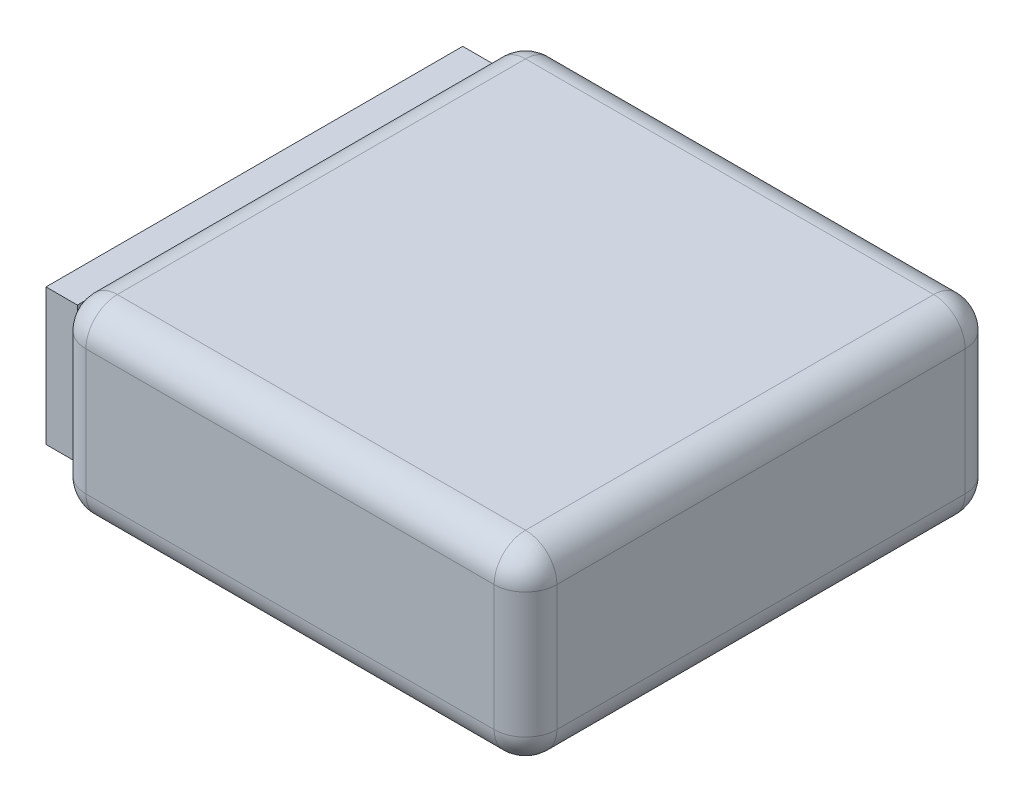
ISO-10303-21;
HEADER;
FILE_DESCRIPTION(('STEP AP214'),'2;1');
FILE_NAME('part.step','',(''),(''),'','','');
FILE_SCHEMA(('AUTOMOTIVE_DESIGN { 1 0 10303 214 1 1 1 1 }'));
ENDSEC;
DATA;
#1=APPLICATION_CONTEXT('core data for automotive mechanical design processes');
#2=APPLICATION_PROTOCOL_DEFINITION('international standard','automotive_design',2000,#1);
#3=PRODUCT_CONTEXT('',#1,'mechanical');
#4=PRODUCT('Part','Part','',(#3));
#5=PRODUCT_RELATED_PRODUCT_CATEGORY('part','',(#4));
#6=PRODUCT_DEFINITION_FORMATION('','',#4);
#7=PRODUCT_DEFINITION_CONTEXT('part definition',#1,'design');
#8=PRODUCT_DEFINITION('design','',#6,#7);
#9=PRODUCT_DEFINITION_SHAPE('','',#8);
#10=(LENGTH_UNIT() NAMED_UNIT(*) SI_UNIT(.MILLI.,.METRE.));
#11=(NAMED_UNIT(*) PLANE_ANGLE_UNIT() SI_UNIT($,.RADIAN.));
#12=(NAMED_UNIT(*) SI_UNIT($,.STERADIAN.) SOLID_ANGLE_UNIT());
#13=UNCERTAINTY_MEASURE_WITH_UNIT(LENGTH_MEASURE(1.E-05),#10,'distance_accuracy_value','');
#14=(GEOMETRIC_REPRESENTATION_CONTEXT(3) GLOBAL_UNCERTAINTY_ASSIGNED_CONTEXT((#13)) GLOBAL_UNIT_ASSIGNED_CONTEXT((#10,
#11,#12)) REPRESENTATION_CONTEXT('',''));
#15=CARTESIAN_POINT('',(0.,0.,0.));
#16=DIRECTION('',(0.,0.,1.));
#17=DIRECTION('',(1.,0.,0.));
#18=AXIS2_PLACEMENT_3D('',#15,#16,#17);
#19=CARTESIAN_POINT('',(-19.787002788647,6.,12.1518006256364));
#20=DIRECTION('',(0.,0.,-1.));
#21=DIRECTION('',(-1.,0.,0.));
#22=AXIS2_PLACEMENT_3D('',#19,#20,#21);
#23=PLANE('',#22);
#24=DIRECTION('',(0.,-1.,0.));
#25=VECTOR('',#24,1.);
#26=CARTESIAN_POINT('',(-18.787002788647,6.,12.1518006256364));
#27=LINE('',#26,#25);
#28=CARTESIAN_POINT('',(-18.787002788647,5.,12.1518006256364));
#29=VERTEX_POINT('',#28);
#30=CARTESIAN_POINT('',(-18.787002788647,1.,12.1518006256364));
#31=VERTEX_POINT('',#30);
#32=EDGE_CURVE('E216',#29,#31,#27,.T.);
#33=ORIENTED_EDGE('',*,*,#32,.T.);
#34=DIRECTION('',(1.,0.,0.));
#35=VECTOR('',#34,1.);
#36=CARTESIAN_POINT('',(-4.78700278864695,1.,12.1518006256364));
#37=LINE('',#36,#35);
#38=CARTESIAN_POINT('',(-5.78700278864695,1.,12.1518006256364));
#39=VERTEX_POINT('',#38);
#40=EDGE_CURVE('E220',#31,#39,#37,.T.);
#41=ORIENTED_EDGE('',*,*,#40,.T.);
#42=DIRECTION('',(0.,-1.,0.));
#43=VECTOR('',#42,1.);
#44=CARTESIAN_POINT('',(-5.78700278864695,6.,12.1518006256364));
#45=LINE('',#44,#43);
#46=CARTESIAN_POINT('',(-5.78700278864695,5.,12.1518006256364));
#47=VERTEX_POINT('',#46);
#48=EDGE_CURVE('E218',#39,#47,#45,.F.);
#49=ORIENTED_EDGE('',*,*,#48,.T.);
#50=DIRECTION('',(1.,0.,0.));
#51=VECTOR('',#50,1.);
#52=CARTESIAN_POINT('',(-19.787002788647,5.,12.1518006256364));
#53=LINE('',#52,#51);
#54=EDGE_CURVE('E214',#47,#29,#53,.F.);
#55=ORIENTED_EDGE('',*,*,#54,.T.);
#56=EDGE_LOOP('',(#33,#41,#49,#55));
#57=FACE_BOUND('',#56,.T.);
#58=ADVANCED_FACE('F32',(#57),#23,.F.);
#59=CARTESIAN_POINT('',(-4.78700278864695,6.,12.1518006256364));
#60=DIRECTION('',(-1.,0.,0.));
#61=DIRECTION('',(0.,0.,1.));
#62=AXIS2_PLACEMENT_3D('',#59,#60,#61);
#63=PLANE('',#62);
#64=DIRECTION('',(0.,-1.,0.));
#65=VECTOR('',#64,1.);
#66=CARTESIAN_POINT('',(-4.78700278864695,6.,11.1518006256364));
#67=LINE('',#66,#65);
#68=CARTESIAN_POINT('',(-4.78700278864695,5.,11.1518006256364));
#69=VERTEX_POINT('',#68);
#70=CARTESIAN_POINT('',(-4.78700278864695,1.,11.1518006256364));
#71=VERTEX_POINT('',#70);
#72=EDGE_CURVE('E207',#69,#71,#67,.T.);
#73=ORIENTED_EDGE('',*,*,#72,.T.);
#74=DIRECTION('',(0.,0.,-1.));
#75=VECTOR('',#74,1.);
#76=CARTESIAN_POINT('',(-4.78700278864695,1.,-2.84819937436359));
#77=LINE('',#76,#75);
#78=CARTESIAN_POINT('',(-4.78700278864695,1.,-1.84819937436359));
#79=VERTEX_POINT('',#78);
#80=EDGE_CURVE('E211',#71,#79,#77,.T.);
#81=ORIENTED_EDGE('',*,*,#80,.T.);
#82=DIRECTION('',(0.,-1.,0.));
#83=VECTOR('',#82,1.);
#84=CARTESIAN_POINT('',(-4.78700278864695,6.,-1.84819937436359));
#85=LINE('',#84,#83);
#86=CARTESIAN_POINT('',(-4.78700278864695,5.,-1.84819937436359));
#87=VERTEX_POINT('',#86);
#88=EDGE_CURVE('E209',#79,#87,#85,.F.);
#89=ORIENTED_EDGE('',*,*,#88,.T.);
#90=DIRECTION('',(0.,0.,-1.));
#91=VECTOR('',#90,1.);
#92=CARTESIAN_POINT('',(-4.78700278864695,5.,12.1518006256364));
#93=LINE('',#92,#91);
#94=EDGE_CURVE('E205',#87,#69,#93,.F.);
#95=ORIENTED_EDGE('',*,*,#94,.T.);
#96=EDGE_LOOP('',(#73,#81,#89,#95));
#97=FACE_BOUND('',#96,.T.);
#98=ADVANCED_FACE('F344',(#97),#63,.F.);
#99=CARTESIAN_POINT('',(-19.787002788647,6.,-2.84819937436359));
#100=DIRECTION('',(0.,0.,1.));
#101=DIRECTION('',(1.,0.,0.));
#102=AXIS2_PLACEMENT_3D('',#99,#100,#101);
#103=PLANE('',#102);
#104=DIRECTION('',(-1.,0.,0.));
#105=VECTOR('',#104,1.);
#106=CARTESIAN_POINT('',(-19.787002788647,1.,-2.84819937436359));
#107=LINE('',#106,#105);
#108=CARTESIAN_POINT('',(-5.78700278864695,1.,-2.84819937436359));
#109=VERTEX_POINT('',#108);
#110=CARTESIAN_POINT('',(-18.787002788647,1.,-2.84819937436359));
#111=VERTEX_POINT('',#110);
#112=EDGE_CURVE('E191',#109,#111,#107,.T.);
#113=ORIENTED_EDGE('',*,*,#112,.T.);
#114=DIRECTION('',(0.,-1.,0.));
#115=VECTOR('',#114,1.);
#116=CARTESIAN_POINT('',(-18.787002788647,6.,-2.84819937436359));
#117=LINE('',#116,#115);
#118=CARTESIAN_POINT('',(-18.787002788647,5.,-2.84819937436359));
#119=VERTEX_POINT('',#118);
#120=EDGE_CURVE('E193',#111,#119,#117,.F.);
#121=ORIENTED_EDGE('',*,*,#120,.T.);
#122=DIRECTION('',(-1.,0.,0.));
#123=VECTOR('',#122,1.);
#124=CARTESIAN_POINT('',(-19.787002788647,5.,-2.84819937436359));
#125=LINE('',#124,#123);
#126=CARTESIAN_POINT('',(-5.78700278864695,5.,-2.84819937436359));
#127=VERTEX_POINT('',#126);
#128=EDGE_CURVE('E187',#119,#127,#125,.F.);
#129=ORIENTED_EDGE('',*,*,#128,.T.);
#130=DIRECTION('',(0.,-1.,0.));
#131=VECTOR('',#130,1.);
#132=CARTESIAN_POINT('',(-5.78700278864695,6.,-2.84819937436359));
#133=LINE('',#132,#131);
#134=EDGE_CURVE('E189',#127,#109,#133,.T.);
#135=ORIENTED_EDGE('',*,*,#134,.T.);
#136=EDGE_LOOP('',(#113,#121,#129,#135));
#137=FACE_BOUND('',#136,.T.);
#138=ADVANCED_FACE('F358',(#137),#103,.F.);
#139=CARTESIAN_POINT('',(0.,6.,0.));
#140=DIRECTION('',(0.,-1.,0.));
#141=DIRECTION('',(0.,0.,-1.));
#142=AXIS2_PLACEMENT_3D('',#139,#140,#141);
#143=PLANE('',#142);
#144=DIRECTION('',(-1.,0.,0.));
#145=VECTOR('',#144,1.);
#146=CARTESIAN_POINT('',(0.,6.,-1.84819937436359));
#147=LINE('',#146,#145);
#148=CARTESIAN_POINT('',(-5.78700278864695,6.,-1.84819937436359));
#149=VERTEX_POINT('',#148);
#150=CARTESIAN_POINT('',(-18.787002788647,6.,-1.84819937436359));
#151=VERTEX_POINT('',#150);
#152=EDGE_CURVE('E41',#149,#151,#147,.T.);
#153=ORIENTED_EDGE('',*,*,#152,.T.);
#154=DIRECTION('',(0.,0.,1.));
#155=VECTOR('',#154,1.);
#156=CARTESIAN_POINT('',(-18.787002788647,6.,0.));
#157=LINE('',#156,#155);
#158=CARTESIAN_POINT('',(-18.787002788647,6.,11.1518006256364));
#159=VERTEX_POINT('',#158);
#160=EDGE_CURVE('E11',#151,#159,#157,.T.);
#161=ORIENTED_EDGE('',*,*,#160,.T.);
#162=DIRECTION('',(1.,0.,0.));
#163=VECTOR('',#162,1.);
#164=CARTESIAN_POINT('',(0.,6.,11.1518006256364));
#165=LINE('',#164,#163);
#166=CARTESIAN_POINT('',(-5.78700278864695,6.,11.1518006256364));
#167=VERTEX_POINT('',#166);
#168=EDGE_CURVE('E223',#159,#167,#165,.T.);
#169=ORIENTED_EDGE('',*,*,#168,.T.);
#170=DIRECTION('',(0.,0.,-1.));
#171=VECTOR('',#170,1.);
#172=CARTESIAN_POINT('',(-5.78700278864695,6.,0.));
#173=LINE('',#172,#171);
#174=EDGE_CURVE('E52',#167,#149,#173,.T.);
#175=ORIENTED_EDGE('',*,*,#174,.T.);
#176=EDGE_LOOP('',(#153,#161,#169,#175));
#177=FACE_BOUND('',#176,.T.);
#178=ADVANCED_FACE('F317',(#177),#143,.F.);
#179=CARTESIAN_POINT('',(0.,0.,0.));
#180=DIRECTION('',(0.,-1.,0.));
#181=DIRECTION('',(0.,0.,-1.));
#182=AXIS2_PLACEMENT_3D('',#179,#180,#181);
#183=PLANE('',#182);
#184=DIRECTION('',(0.,0.,1.));
#185=VECTOR('',#184,1.);
#186=CARTESIAN_POINT('',(-18.787002788647,0.,-2.84819937436359));
#187=LINE('',#186,#185);
#188=CARTESIAN_POINT('',(-18.787002788647,0.,11.1518006256364));
#189=VERTEX_POINT('',#188);
#190=CARTESIAN_POINT('',(-18.787002788647,0.,-1.84819937436359));
#191=VERTEX_POINT('',#190);
#192=EDGE_CURVE('E200',#189,#191,#187,.F.);
#193=ORIENTED_EDGE('',*,*,#192,.T.);
#194=DIRECTION('',(-1.,0.,0.));
#195=VECTOR('',#194,1.);
#196=CARTESIAN_POINT('',(-4.78700278864695,0.,-1.84819937436359));
#197=LINE('',#196,#195);
#198=CARTESIAN_POINT('',(-5.78700278864695,0.,-1.84819937436359));
#199=VERTEX_POINT('',#198);
#200=EDGE_CURVE('E202',#191,#199,#197,.F.);
#201=ORIENTED_EDGE('',*,*,#200,.T.);
#202=DIRECTION('',(0.,0.,-1.));
#203=VECTOR('',#202,1.);
#204=CARTESIAN_POINT('',(-5.78700278864695,0.,12.1518006256364));
#205=LINE('',#204,#203);
#206=CARTESIAN_POINT('',(-5.78700278864695,0.,11.1518006256364));
#207=VERTEX_POINT('',#206);
#208=EDGE_CURVE('E198',#199,#207,#205,.F.);
#209=ORIENTED_EDGE('',*,*,#208,.T.);
#210=DIRECTION('',(1.,0.,0.));
#211=VECTOR('',#210,1.);
#212=CARTESIAN_POINT('',(-19.787002788647,0.,11.1518006256364));
#213=LINE('',#212,#211);
#214=EDGE_CURVE('E196',#207,#189,#213,.F.);
#215=ORIENTED_EDGE('',*,*,#214,.T.);
#216=EDGE_LOOP('',(#193,#201,#209,#215));
#217=FACE_BOUND('',#216,.T.);
#218=ADVANCED_FACE('F346',(#217),#183,.T.);
#219=CARTESIAN_POINT('',(-5.78700278864695,6.,11.1518006256364));
#220=DIRECTION('',(0.,-1.,0.));
#221=DIRECTION('',(0.,0.,-1.));
#222=AXIS2_PLACEMENT_3D('',#219,#220,#221);
#223=CYLINDRICAL_SURFACE('',#222,1.);
#224=CARTESIAN_POINT('',(-5.78700278864695,5.,11.1518006256364));
#225=DIRECTION('',(0.,1.,0.));
#226=DIRECTION('',(0.,0.,1.));
#227=AXIS2_PLACEMENT_3D('',#224,#225,#226);
#228=CIRCLE('',#227,1.);
#229=EDGE_CURVE('E36',#47,#69,#228,.T.);
#230=ORIENTED_EDGE('',*,*,#229,.F.);
#231=ORIENTED_EDGE('',*,*,#48,.F.);
#232=CARTESIAN_POINT('',(-5.78700278864695,1.,11.1518006256364));
#233=DIRECTION('',(0.,-1.,0.));
#234=DIRECTION('',(0.,0.,-1.));
#235=AXIS2_PLACEMENT_3D('',#232,#233,#234);
#236=CIRCLE('',#235,1.);
#237=EDGE_CURVE('E283',#71,#39,#236,.T.);
#238=ORIENTED_EDGE('',*,*,#237,.F.);
#239=ORIENTED_EDGE('',*,*,#72,.F.);
#240=EDGE_LOOP('',(#230,#231,#238,#239));
#241=FACE_BOUND('',#240,.T.);
#242=ADVANCED_FACE('F34',(#241),#223,.T.);
#243=CARTESIAN_POINT('',(-5.78700278864695,5.,11.1518006256364));
#244=DIRECTION('',(0.,0.,1.));
#245=DIRECTION('',(1.,0.,0.));
#246=AXIS2_PLACEMENT_3D('',#243,#244,#245);
#247=SPHERICAL_SURFACE('',#246,1.);
#248=CARTESIAN_POINT('',(-5.78700278864695,5.,11.1518006256364));
#249=DIRECTION('',(1.,0.,0.));
#250=DIRECTION('',(0.,0.,-1.));
#251=AXIS2_PLACEMENT_3D('',#248,#249,#250);
#252=CIRCLE('',#251,1.);
#253=EDGE_CURVE('E278',#47,#167,#252,.F.);
#254=ORIENTED_EDGE('',*,*,#253,.F.);
#255=ORIENTED_EDGE('',*,*,#229,.T.);
#256=CARTESIAN_POINT('',(-5.78700278864695,5.,11.1518006256364));
#257=DIRECTION('',(0.,0.,1.));
#258=DIRECTION('',(1.,0.,0.));
#259=AXIS2_PLACEMENT_3D('',#256,#257,#258);
#260=CIRCLE('',#259,1.);
#261=EDGE_CURVE('E281',#167,#69,#260,.F.);
#262=ORIENTED_EDGE('',*,*,#261,.F.);
#263=EDGE_LOOP('',(#254,#255,#262));
#264=FACE_BOUND('',#263,.T.);
#265=ADVANCED_FACE('F295',(#264),#247,.T.);
#266=CARTESIAN_POINT('',(-5.78700278864695,1.,11.1518006256364));
#267=DIRECTION('',(0.,0.,1.));
#268=DIRECTION('',(1.,0.,0.));
#269=AXIS2_PLACEMENT_3D('',#266,#267,#268);
#270=SPHERICAL_SURFACE('',#269,1.);
#271=CARTESIAN_POINT('',(-5.78700278864695,1.,11.1518006256364));
#272=DIRECTION('',(0.,0.,1.));
#273=DIRECTION('',(1.,0.,0.));
#274=AXIS2_PLACEMENT_3D('',#271,#272,#273);
#275=CIRCLE('',#274,1.);
#276=EDGE_CURVE('E273',#71,#207,#275,.F.);
#277=ORIENTED_EDGE('',*,*,#276,.F.);
#278=ORIENTED_EDGE('',*,*,#237,.T.);
#279=CARTESIAN_POINT('',(-5.78700278864695,1.,11.1518006256364));
#280=DIRECTION('',(1.,0.,0.));
#281=DIRECTION('',(0.,0.,-1.));
#282=AXIS2_PLACEMENT_3D('',#279,#280,#281);
#283=CIRCLE('',#282,1.);
#284=EDGE_CURVE('E276',#207,#39,#283,.F.);
#285=ORIENTED_EDGE('',*,*,#284,.F.);
#286=EDGE_LOOP('',(#277,#278,#285));
#287=FACE_BOUND('',#286,.T.);
#288=ADVANCED_FACE('F336',(#287),#270,.T.);
#289=CARTESIAN_POINT('',(-5.78700278864695,5.,0.));
#290=DIRECTION('',(0.,0.,-1.));
#291=DIRECTION('',(-1.,0.,0.));
#292=AXIS2_PLACEMENT_3D('',#289,#290,#291);
#293=CYLINDRICAL_SURFACE('',#292,1.);
#294=ORIENTED_EDGE('',*,*,#261,.T.);
#295=ORIENTED_EDGE('',*,*,#94,.F.);
#296=CARTESIAN_POINT('',(-5.78700278864695,5.,-1.84819937436359));
#297=DIRECTION('',(0.,0.,-1.));
#298=DIRECTION('',(-1.,0.,0.));
#299=AXIS2_PLACEMENT_3D('',#296,#297,#298);
#300=CIRCLE('',#299,1.);
#301=EDGE_CURVE('E267',#149,#87,#300,.T.);
#302=ORIENTED_EDGE('',*,*,#301,.F.);
#303=ORIENTED_EDGE('',*,*,#174,.F.);
#304=EDGE_LOOP('',(#294,#295,#302,#303));
#305=FACE_BOUND('',#304,.T.);
#306=ADVANCED_FACE('F301',(#305),#293,.T.);
#307=CARTESIAN_POINT('',(0.,5.,11.1518006256364));
#308=DIRECTION('',(1.,0.,0.));
#309=DIRECTION('',(0.,0.,-1.));
#310=AXIS2_PLACEMENT_3D('',#307,#308,#309);
#311=CYLINDRICAL_SURFACE('',#310,1.);
#312=ORIENTED_EDGE('',*,*,#253,.T.);
#313=ORIENTED_EDGE('',*,*,#168,.F.);
#314=CARTESIAN_POINT('',(-18.787002788647,5.,11.1518006256364));
#315=DIRECTION('',(-1.,0.,0.));
#316=DIRECTION('',(0.,0.,1.));
#317=AXIS2_PLACEMENT_3D('',#314,#315,#316);
#318=CIRCLE('',#317,1.);
#319=EDGE_CURVE('E264',#29,#159,#318,.T.);
#320=ORIENTED_EDGE('',*,*,#319,.F.);
#321=ORIENTED_EDGE('',*,*,#54,.F.);
#322=EDGE_LOOP('',(#312,#313,#320,#321));
#323=FACE_BOUND('',#322,.T.);
#324=ADVANCED_FACE('F321',(#323),#311,.T.);
#325=CARTESIAN_POINT('',(-18.787002788647,6.,11.1518006256364));
#326=DIRECTION('',(0.,-1.,0.));
#327=DIRECTION('',(0.,0.,-1.));
#328=AXIS2_PLACEMENT_3D('',#325,#326,#327);
#329=CYLINDRICAL_SURFACE('',#328,1.);
#330=CARTESIAN_POINT('',(-18.787002788647,1.,11.1518006256364));
#331=DIRECTION('',(0.,-1.,0.));
#332=DIRECTION('',(0.,0.,-1.));
#333=AXIS2_PLACEMENT_3D('',#330,#331,#332);
#334=CIRCLE('',#333,1.);
#335=CARTESIAN_POINT('',(-19.787002788647,1.,11.1518006256364));
#336=VERTEX_POINT('',#335);
#337=EDGE_CURVE('E258',#31,#336,#334,.T.);
#338=ORIENTED_EDGE('',*,*,#337,.F.);
#339=ORIENTED_EDGE('',*,*,#32,.F.);
#340=CARTESIAN_POINT('',(-18.787002788647,5.,11.1518006256364));
#341=DIRECTION('',(0.,1.,0.));
#342=DIRECTION('',(0.,0.,1.));
#343=AXIS2_PLACEMENT_3D('',#340,#341,#342);
#344=CIRCLE('',#343,1.);
#345=CARTESIAN_POINT('',(-19.787002788647,5.,11.1518006256364));
#346=VERTEX_POINT('',#345);
#347=EDGE_CURVE('E261',#346,#29,#344,.T.);
#348=ORIENTED_EDGE('',*,*,#347,.F.);
#349=DIRECTION('',(0.,-1.,0.));
#350=VECTOR('',#349,1.);
#351=CARTESIAN_POINT('',(-19.787002788647,6.,11.1518006256364));
#352=LINE('',#351,#350);
#353=EDGE_CURVE('E181',#336,#346,#352,.F.);
#354=ORIENTED_EDGE('',*,*,#353,.F.);
#355=EDGE_LOOP('',(#338,#339,#348,#354));
#356=FACE_BOUND('',#355,.T.);
#357=ADVANCED_FACE('F327',(#356),#329,.T.);
#358=CARTESIAN_POINT('',(-19.787002788647,1.,11.1518006256364));
#359=DIRECTION('',(-1.,0.,0.));
#360=DIRECTION('',(0.,0.,1.));
#361=AXIS2_PLACEMENT_3D('',#358,#359,#360);
#362=CYLINDRICAL_SURFACE('',#361,1.);
#363=ORIENTED_EDGE('',*,*,#284,.T.);
#364=ORIENTED_EDGE('',*,*,#40,.F.);
#365=CARTESIAN_POINT('',(-18.787002788647,1.,11.1518006256364));
#366=DIRECTION('',(-1.,0.,0.));
#367=DIRECTION('',(0.,0.,1.));
#368=AXIS2_PLACEMENT_3D('',#365,#366,#367);
#369=CIRCLE('',#368,1.);
#370=EDGE_CURVE('E255',#189,#31,#369,.T.);
#371=ORIENTED_EDGE('',*,*,#370,.F.);
#372=ORIENTED_EDGE('',*,*,#214,.F.);
#373=EDGE_LOOP('',(#363,#364,#371,#372));
#374=FACE_BOUND('',#373,.T.);
#375=ADVANCED_FACE('F335',(#374),#362,.T.);
#376=CARTESIAN_POINT('',(-5.78700278864695,1.,12.1518006256364));
#377=DIRECTION('',(0.,0.,1.));
#378=DIRECTION('',(1.,0.,0.));
#379=AXIS2_PLACEMENT_3D('',#376,#377,#378);
#380=CYLINDRICAL_SURFACE('',#379,1.);
#381=ORIENTED_EDGE('',*,*,#276,.T.);
#382=ORIENTED_EDGE('',*,*,#208,.F.);
#383=CARTESIAN_POINT('',(-5.78700278864695,1.,-1.84819937436359));
#384=DIRECTION('',(0.,0.,-1.));
#385=DIRECTION('',(-1.,0.,0.));
#386=AXIS2_PLACEMENT_3D('',#383,#384,#385);
#387=CIRCLE('',#386,1.);
#388=EDGE_CURVE('E252',#79,#199,#387,.T.);
#389=ORIENTED_EDGE('',*,*,#388,.F.);
#390=ORIENTED_EDGE('',*,*,#80,.F.);
#391=EDGE_LOOP('',(#381,#382,#389,#390));
#392=FACE_BOUND('',#391,.T.);
#393=ADVANCED_FACE('F341',(#392),#380,.T.);
#394=CARTESIAN_POINT('',(-5.78700278864695,6.,-1.84819937436359));
#395=DIRECTION('',(0.,-1.,0.));
#396=DIRECTION('',(0.,0.,-1.));
#397=AXIS2_PLACEMENT_3D('',#394,#395,#396);
#398=CYLINDRICAL_SURFACE('',#397,1.);
#399=CARTESIAN_POINT('',(-5.78700278864695,5.,-1.84819937436359));
#400=DIRECTION('',(0.,1.,0.));
#401=DIRECTION('',(0.,0.,1.));
#402=AXIS2_PLACEMENT_3D('',#399,#400,#401);
#403=CIRCLE('',#402,1.);
#404=EDGE_CURVE('E270',#87,#127,#403,.T.);
#405=ORIENTED_EDGE('',*,*,#404,.F.);
#406=ORIENTED_EDGE('',*,*,#88,.F.);
#407=CARTESIAN_POINT('',(-5.78700278864695,1.,-1.84819937436359));
#408=DIRECTION('',(0.,-1.,0.));
#409=DIRECTION('',(0.,0.,-1.));
#410=AXIS2_PLACEMENT_3D('',#407,#408,#409);
#411=CIRCLE('',#410,1.);
#412=EDGE_CURVE('E250',#109,#79,#411,.T.);
#413=ORIENTED_EDGE('',*,*,#412,.F.);
#414=ORIENTED_EDGE('',*,*,#134,.F.);
#415=EDGE_LOOP('',(#405,#406,#413,#414));
#416=FACE_BOUND('',#415,.T.);
#417=ADVANCED_FACE('F396',(#416),#398,.T.);
#418=CARTESIAN_POINT('',(-5.78700278864695,5.,-1.84819937436359));
#419=DIRECTION('',(0.,0.,1.));
#420=DIRECTION('',(1.,0.,0.));
#421=AXIS2_PLACEMENT_3D('',#418,#419,#420);
#422=SPHERICAL_SURFACE('',#421,1.);
#423=ORIENTED_EDGE('',*,*,#301,.T.);
#424=ORIENTED_EDGE('',*,*,#404,.T.);
#425=CARTESIAN_POINT('',(-5.78700278864695,5.,-1.84819937436359));
#426=DIRECTION('',(1.,0.,0.));
#427=DIRECTION('',(0.,1.,0.));
#428=AXIS2_PLACEMENT_3D('',#425,#426,#427);
#429=CIRCLE('',#428,1.);
#430=EDGE_CURVE('E247',#149,#127,#429,.F.);
#431=ORIENTED_EDGE('',*,*,#430,.F.);
#432=EDGE_LOOP('',(#423,#424,#431));
#433=FACE_BOUND('',#432,.T.);
#434=ADVANCED_FACE('F305',(#433),#422,.T.);
#435=CARTESIAN_POINT('',(-18.787002788647,5.,11.1518006256364));
#436=DIRECTION('',(0.,0.,1.));
#437=DIRECTION('',(1.,0.,0.));
#438=AXIS2_PLACEMENT_3D('',#435,#436,#437);
#439=SPHERICAL_SURFACE('',#438,1.);
#440=ORIENTED_EDGE('',*,*,#347,.T.);
#441=ORIENTED_EDGE('',*,*,#319,.T.);
#442=CARTESIAN_POINT('',(-18.787002788647,5.,11.1518006256364));
#443=DIRECTION('',(0.,0.,1.));
#444=DIRECTION('',(1.,0.,0.));
#445=AXIS2_PLACEMENT_3D('',#442,#443,#444);
#446=CIRCLE('',#445,1.);
#447=EDGE_CURVE('E245',#346,#159,#446,.F.);
#448=ORIENTED_EDGE('',*,*,#447,.F.);
#449=EDGE_LOOP('',(#440,#441,#448));
#450=FACE_BOUND('',#449,.T.);
#451=ADVANCED_FACE('F390',(#450),#439,.T.);
#452=CARTESIAN_POINT('',(-18.787002788647,1.,11.1518006256364));
#453=DIRECTION('',(0.,0.,1.));
#454=DIRECTION('',(1.,0.,0.));
#455=AXIS2_PLACEMENT_3D('',#452,#453,#454);
#456=SPHERICAL_SURFACE('',#455,1.);
#457=ORIENTED_EDGE('',*,*,#370,.T.);
#458=ORIENTED_EDGE('',*,*,#337,.T.);
#459=CARTESIAN_POINT('',(-18.787002788647,1.,11.1518006256364));
#460=DIRECTION('',(0.,0.,1.));
#461=DIRECTION('',(1.,0.,0.));
#462=AXIS2_PLACEMENT_3D('',#459,#460,#461);
#463=CIRCLE('',#462,1.);
#464=EDGE_CURVE('E242',#189,#336,#463,.F.);
#465=ORIENTED_EDGE('',*,*,#464,.F.);
#466=EDGE_LOOP('',(#457,#458,#465));
#467=FACE_BOUND('',#466,.T.);
#468=ADVANCED_FACE('F331',(#467),#456,.T.);
#469=CARTESIAN_POINT('',(-5.78700278864695,1.,-1.84819937436359));
#470=DIRECTION('',(0.,0.,1.));
#471=DIRECTION('',(1.,0.,0.));
#472=AXIS2_PLACEMENT_3D('',#469,#470,#471);
#473=SPHERICAL_SURFACE('',#472,1.);
#474=ORIENTED_EDGE('',*,*,#412,.T.);
#475=ORIENTED_EDGE('',*,*,#388,.T.);
#476=CARTESIAN_POINT('',(-5.78700278864695,1.,-1.84819937436359));
#477=DIRECTION('',(1.,0.,0.));
#478=DIRECTION('',(0.,0.,-1.));
#479=AXIS2_PLACEMENT_3D('',#476,#477,#478);
#480=CIRCLE('',#479,1.);
#481=EDGE_CURVE('E240',#109,#199,#480,.F.);
#482=ORIENTED_EDGE('',*,*,#481,.F.);
#483=EDGE_LOOP('',(#474,#475,#482));
#484=FACE_BOUND('',#483,.T.);
#485=ADVANCED_FACE('F384',(#484),#473,.T.);
#486=CARTESIAN_POINT('',(0.,5.,-1.84819937436359));
#487=DIRECTION('',(-1.,0.,0.));
#488=DIRECTION('',(0.,0.,1.));
#489=AXIS2_PLACEMENT_3D('',#486,#487,#488);
#490=CYLINDRICAL_SURFACE('',#489,1.);
#491=ORIENTED_EDGE('',*,*,#430,.T.);
#492=ORIENTED_EDGE('',*,*,#128,.F.);
#493=CARTESIAN_POINT('',(-18.787002788647,5.,-1.84819937436359));
#494=DIRECTION('',(-1.,0.,0.));
#495=DIRECTION('',(0.,0.,1.));
#496=AXIS2_PLACEMENT_3D('',#493,#494,#495);
#497=CIRCLE('',#496,1.);
#498=EDGE_CURVE('E237',#151,#119,#497,.T.);
#499=ORIENTED_EDGE('',*,*,#498,.F.);
#500=ORIENTED_EDGE('',*,*,#152,.F.);
#501=EDGE_LOOP('',(#491,#492,#499,#500));
#502=FACE_BOUND('',#501,.T.);
#503=ADVANCED_FACE('F309',(#502),#490,.T.);
#504=CARTESIAN_POINT('',(-18.787002788647,5.,0.));
#505=DIRECTION('',(0.,0.,1.));
#506=DIRECTION('',(1.,0.,0.));
#507=AXIS2_PLACEMENT_3D('',#504,#505,#506);
#508=CYLINDRICAL_SURFACE('',#507,1.);
#509=ORIENTED_EDGE('',*,*,#447,.T.);
#510=ORIENTED_EDGE('',*,*,#160,.F.);
#511=CARTESIAN_POINT('',(-18.787002788647,5.,-1.84819937436359));
#512=DIRECTION('',(0.,0.,-1.));
#513=DIRECTION('',(0.,1.,0.));
#514=AXIS2_PLACEMENT_3D('',#511,#512,#513);
#515=CIRCLE('',#514,1.);
#516=CARTESIAN_POINT('',(-19.787002788647,5.,-1.84819937436359));
#517=VERTEX_POINT('',#516);
#518=EDGE_CURVE('E234',#517,#151,#515,.T.);
#519=ORIENTED_EDGE('',*,*,#518,.F.);
#520=DIRECTION('',(0.,0.,1.));
#521=VECTOR('',#520,1.);
#522=CARTESIAN_POINT('',(-19.787002788647,5.,12.1518006256364));
#523=LINE('',#522,#521);
#524=EDGE_CURVE('E178',#346,#517,#523,.F.);
#525=ORIENTED_EDGE('',*,*,#524,.F.);
#526=EDGE_LOOP('',(#509,#510,#519,#525));
#527=FACE_BOUND('',#526,.T.);
#528=ADVANCED_FACE('F315',(#527),#508,.T.);
#529=CARTESIAN_POINT('',(-18.787002788647,1.,12.1518006256364));
#530=DIRECTION('',(0.,0.,-1.));
#531=DIRECTION('',(-1.,0.,0.));
#532=AXIS2_PLACEMENT_3D('',#529,#530,#531);
#533=CYLINDRICAL_SURFACE('',#532,1.);
#534=ORIENTED_EDGE('',*,*,#464,.T.);
#535=DIRECTION('',(0.,0.,1.));
#536=VECTOR('',#535,1.);
#537=CARTESIAN_POINT('',(-19.787002788647,1.,12.1518006256364));
#538=LINE('',#537,#536);
#539=CARTESIAN_POINT('',(-19.787002788647,1.,-1.84819937436359));
#540=VERTEX_POINT('',#539);
#541=EDGE_CURVE('E184',#540,#336,#538,.T.);
#542=ORIENTED_EDGE('',*,*,#541,.F.);
#543=CARTESIAN_POINT('',(-18.787002788647,1.,-1.84819937436359));
#544=DIRECTION('',(0.,0.,-1.));
#545=DIRECTION('',(-1.,0.,0.));
#546=AXIS2_PLACEMENT_3D('',#543,#544,#545);
#547=CIRCLE('',#546,1.);
#548=EDGE_CURVE('E231',#191,#540,#547,.T.);
#549=ORIENTED_EDGE('',*,*,#548,.F.);
#550=ORIENTED_EDGE('',*,*,#192,.F.);
#551=EDGE_LOOP('',(#534,#542,#549,#550));
#552=FACE_BOUND('',#551,.T.);
#553=ADVANCED_FACE('F375',(#552),#533,.T.);
#554=CARTESIAN_POINT('',(-19.787002788647,1.,-1.84819937436359));
#555=DIRECTION('',(1.,0.,0.));
#556=DIRECTION('',(0.,0.,-1.));
#557=AXIS2_PLACEMENT_3D('',#554,#555,#556);
#558=CYLINDRICAL_SURFACE('',#557,1.);
#559=ORIENTED_EDGE('',*,*,#481,.T.);
#560=ORIENTED_EDGE('',*,*,#200,.F.);
#561=CARTESIAN_POINT('',(-18.787002788647,1.,-1.84819937436359));
#562=DIRECTION('',(-1.,0.,0.));
#563=DIRECTION('',(0.,0.,1.));
#564=AXIS2_PLACEMENT_3D('',#561,#562,#563);
#565=CIRCLE('',#564,1.);
#566=EDGE_CURVE('E228',#111,#191,#565,.T.);
#567=ORIENTED_EDGE('',*,*,#566,.F.);
#568=ORIENTED_EDGE('',*,*,#112,.F.);
#569=EDGE_LOOP('',(#559,#560,#567,#568));
#570=FACE_BOUND('',#569,.T.);
#571=ADVANCED_FACE('F372',(#570),#558,.T.);
#572=CARTESIAN_POINT('',(-18.787002788647,5.,-1.84819937436359));
#573=DIRECTION('',(0.,0.,1.));
#574=DIRECTION('',(1.,0.,0.));
#575=AXIS2_PLACEMENT_3D('',#572,#573,#574);
#576=SPHERICAL_SURFACE('',#575,1.);
#577=ORIENTED_EDGE('',*,*,#518,.T.);
#578=ORIENTED_EDGE('',*,*,#498,.T.);
#579=CARTESIAN_POINT('',(-18.787002788647,5.,-1.84819937436359));
#580=DIRECTION('',(0.,1.,0.));
#581=DIRECTION('',(0.,0.,1.));
#582=AXIS2_PLACEMENT_3D('',#579,#580,#581);
#583=CIRCLE('',#582,1.);
#584=EDGE_CURVE('E172',#517,#119,#583,.F.);
#585=ORIENTED_EDGE('',*,*,#584,.F.);
#586=EDGE_LOOP('',(#577,#578,#585));
#587=FACE_BOUND('',#586,.T.);
#588=ADVANCED_FACE('F312',(#587),#576,.T.);
#589=CARTESIAN_POINT('',(-18.787002788647,1.,-1.84819937436359));
#590=DIRECTION('',(0.,0.,1.));
#591=DIRECTION('',(1.,0.,0.));
#592=AXIS2_PLACEMENT_3D('',#589,#590,#591);
#593=SPHERICAL_SURFACE('',#592,1.);
#594=ORIENTED_EDGE('',*,*,#566,.T.);
#595=ORIENTED_EDGE('',*,*,#548,.T.);
#596=CARTESIAN_POINT('',(-18.787002788647,1.,-1.84819937436359));
#597=DIRECTION('',(0.,-1.,0.));
#598=DIRECTION('',(0.,0.,-1.));
#599=AXIS2_PLACEMENT_3D('',#596,#597,#598);
#600=CIRCLE('',#599,1.);
#601=EDGE_CURVE('E169',#111,#540,#600,.F.);
#602=ORIENTED_EDGE('',*,*,#601,.F.);
#603=EDGE_LOOP('',(#594,#595,#602));
#604=FACE_BOUND('',#603,.T.);
#605=ADVANCED_FACE('F365',(#604),#593,.T.);
#606=CARTESIAN_POINT('',(-18.787002788647,6.,-1.84819937436359));
#607=DIRECTION('',(0.,-1.,0.));
#608=DIRECTION('',(0.,0.,-1.));
#609=AXIS2_PLACEMENT_3D('',#606,#607,#608);
#610=CYLINDRICAL_SURFACE('',#609,1.);
#611=ORIENTED_EDGE('',*,*,#584,.T.);
#612=ORIENTED_EDGE('',*,*,#120,.F.);
#613=ORIENTED_EDGE('',*,*,#601,.T.);
#614=DIRECTION('',(0.,-1.,0.));
#615=VECTOR('',#614,1.);
#616=CARTESIAN_POINT('',(-19.787002788647,6.,-1.84819937436359));
#617=LINE('',#616,#615);
#618=EDGE_CURVE('E168',#517,#540,#617,.T.);
#619=ORIENTED_EDGE('',*,*,#618,.F.);
#620=EDGE_LOOP('',(#611,#612,#613,#619));
#621=FACE_BOUND('',#620,.T.);
#622=ADVANCED_FACE('F362',(#621),#610,.T.);
#623=CARTESIAN_POINT('',(-20.787002788647,1.,-1.84819937436359));
#624=DIRECTION('',(0.,0.,1.));
#625=DIRECTION('',(1.,0.,0.));
#626=AXIS2_PLACEMENT_3D('',#623,#624,#625);
#627=PLANE('',#626);
#628=DIRECTION('',(0.,-1.,0.));
#629=VECTOR('',#628,1.);
#630=CARTESIAN_POINT('',(-19.787002788647,1.,-1.84819937436359));
#631=LINE('',#630,#629);
#632=CARTESIAN_POINT('',(-19.787002788647,5.34615780058749,-1.84819937436359));
#633=VERTEX_POINT('',#632);
#634=EDGE_CURVE('E627',#633,#517,#631,.T.);
#635=ORIENTED_EDGE('',*,*,#634,.T.);
#636=ORIENTED_EDGE('',*,*,#618,.T.);
#637=DIRECTION('',(1.,0.,0.));
#638=VECTOR('',#637,1.);
#639=CARTESIAN_POINT('',(-20.787002788647,1.,-1.84819937436359));
#640=LINE('',#639,#638);
#641=CARTESIAN_POINT('',(-20.787002788647,1.,-1.84819937436359));
#642=VERTEX_POINT('',#641);
#643=EDGE_CURVE('E147',#642,#540,#640,.T.);
#644=ORIENTED_EDGE('',*,*,#643,.F.);
#645=DIRECTION('',(0.,-1.,0.));
#646=VECTOR('',#645,1.);
#647=CARTESIAN_POINT('',(-20.787002788647,1.,-1.84819937436359));
#648=LINE('',#647,#646);
#649=CARTESIAN_POINT('',(-20.787002788647,5.34615780058749,-1.84819937436359));
#650=VERTEX_POINT('',#649);
#651=EDGE_CURVE('E153',#650,#642,#648,.T.);
#652=ORIENTED_EDGE('',*,*,#651,.F.);
#653=DIRECTION('',(1.,0.,0.));
#654=VECTOR('',#653,1.);
#655=CARTESIAN_POINT('',(-20.787002788647,5.34615780058749,-1.84819937436359));
#656=LINE('',#655,#654);
#657=EDGE_CURVE('E637',#650,#633,#656,.T.);
#658=ORIENTED_EDGE('',*,*,#657,.T.);
#659=EDGE_LOOP('',(#635,#636,#644,#652,#658));
#660=FACE_BOUND('',#659,.T.);
#661=ADVANCED_FACE('F166',(#660),#627,.F.);
#662=CARTESIAN_POINT('',(-20.787002788647,1.,-1.84819937436359));
#663=DIRECTION('',(0.,1.,0.));
#664=DIRECTION('',(0.,0.,1.));
#665=AXIS2_PLACEMENT_3D('',#662,#663,#664);
#666=PLANE('',#665);
#667=ORIENTED_EDGE('',*,*,#541,.T.);
#668=DIRECTION('',(0.,0.,1.));
#669=VECTOR('',#668,1.);
#670=CARTESIAN_POINT('',(-19.787002788647,1.,-1.84819937436359));
#671=LINE('',#670,#669);
#672=CARTESIAN_POINT('',(-19.787002788647,1.,11.4238333938935));
#673=VERTEX_POINT('',#672);
#674=EDGE_CURVE('E624',#336,#673,#671,.T.);
#675=ORIENTED_EDGE('',*,*,#674,.T.);
#676=DIRECTION('',(1.,0.,0.));
#677=VECTOR('',#676,1.);
#678=CARTESIAN_POINT('',(-20.787002788647,1.,11.4238333938935));
#679=LINE('',#678,#677);
#680=CARTESIAN_POINT('',(-20.787002788647,1.,11.4238333938935));
#681=VERTEX_POINT('',#680);
#682=EDGE_CURVE('E149',#681,#673,#679,.T.);
#683=ORIENTED_EDGE('',*,*,#682,.F.);
#684=DIRECTION('',(0.,0.,1.));
#685=VECTOR('',#684,1.);
#686=CARTESIAN_POINT('',(-20.787002788647,1.,-1.84819937436359));
#687=LINE('',#686,#685);
#688=EDGE_CURVE('E142',#642,#681,#687,.T.);
#689=ORIENTED_EDGE('',*,*,#688,.F.);
#690=ORIENTED_EDGE('',*,*,#643,.T.);
#691=EDGE_LOOP('',(#667,#675,#683,#689,#690));
#692=FACE_BOUND('',#691,.T.);
#693=ADVANCED_FACE('F145',(#692),#666,.F.);
#694=CARTESIAN_POINT('',(-20.787002788647,1.,11.4238333938935));
#695=DIRECTION('',(0.,0.,-1.));
#696=DIRECTION('',(-1.,0.,0.));
#697=AXIS2_PLACEMENT_3D('',#694,#695,#696);
#698=PLANE('',#697);
#699=DIRECTION('',(0.,1.,0.));
#700=VECTOR('',#699,1.);
#701=CARTESIAN_POINT('',(-19.787002788647,1.,11.4238333938935));
#702=LINE('',#701,#700);
#703=CARTESIAN_POINT('',(-19.787002788647,5.34615780058749,11.4238333938935));
#704=VERTEX_POINT('',#703);
#705=EDGE_CURVE('E626',#673,#704,#702,.T.);
#706=ORIENTED_EDGE('',*,*,#705,.T.);
#707=DIRECTION('',(1.,0.,0.));
#708=VECTOR('',#707,1.);
#709=CARTESIAN_POINT('',(-20.787002788647,5.34615780058749,11.4238333938935));
#710=LINE('',#709,#708);
#711=CARTESIAN_POINT('',(-20.787002788647,5.34615780058749,11.4238333938935));
#712=VERTEX_POINT('',#711);
#713=EDGE_CURVE('E174',#712,#704,#710,.T.);
#714=ORIENTED_EDGE('',*,*,#713,.F.);
#715=DIRECTION('',(0.,1.,0.));
#716=VECTOR('',#715,1.);
#717=CARTESIAN_POINT('',(-20.787002788647,1.,11.4238333938935));
#718=LINE('',#717,#716);
#719=EDGE_CURVE('E152',#681,#712,#718,.T.);
#720=ORIENTED_EDGE('',*,*,#719,.F.);
#721=ORIENTED_EDGE('',*,*,#682,.T.);
#722=EDGE_LOOP('',(#706,#714,#720,#721));
#723=FACE_BOUND('',#722,.T.);
#724=ADVANCED_FACE('F495',(#723),#698,.F.);
#725=CARTESIAN_POINT('',(-20.787002788647,5.34615780058749,-1.84819937436359));
#726=DIRECTION('',(0.,-1.,0.));
#727=DIRECTION('',(0.,0.,-1.));
#728=AXIS2_PLACEMENT_3D('',#725,#726,#727);
#729=PLANE('',#728);
#730=DIRECTION('',(0.,0.,-1.));
#731=VECTOR('',#730,1.);
#732=CARTESIAN_POINT('',(-19.787002788647,5.34615780058749,-1.84819937436359));
#733=LINE('',#732,#731);
#734=EDGE_CURVE('E162',#704,#633,#733,.T.);
#735=ORIENTED_EDGE('',*,*,#734,.T.);
#736=ORIENTED_EDGE('',*,*,#657,.F.);
#737=DIRECTION('',(0.,0.,-1.));
#738=VECTOR('',#737,1.);
#739=CARTESIAN_POINT('',(-20.787002788647,5.34615780058749,-1.84819937436359));
#740=LINE('',#739,#738);
#741=EDGE_CURVE('E158',#712,#650,#740,.T.);
#742=ORIENTED_EDGE('',*,*,#741,.F.);
#743=ORIENTED_EDGE('',*,*,#713,.T.);
#744=EDGE_LOOP('',(#735,#736,#742,#743));
#745=FACE_BOUND('',#744,.T.);
#746=ADVANCED_FACE('F502',(#745),#729,.F.);
#747=CARTESIAN_POINT('',(-20.787002788647,0.,0.));
#748=DIRECTION('',(1.,0.,0.));
#749=DIRECTION('',(0.,0.,-1.));
#750=AXIS2_PLACEMENT_3D('',#747,#748,#749);
#751=PLANE('',#750);
#752=ORIENTED_EDGE('',*,*,#651,.T.);
#753=ORIENTED_EDGE('',*,*,#688,.T.);
#754=ORIENTED_EDGE('',*,*,#719,.T.);
#755=ORIENTED_EDGE('',*,*,#741,.T.);
#756=EDGE_LOOP('',(#752,#753,#754,#755));
#757=FACE_BOUND('',#756,.T.);
#758=ADVANCED_FACE('F156',(#757),#751,.F.);
#759=CARTESIAN_POINT('',(-19.787002788647,0.,0.));
#760=DIRECTION('',(1.,0.,0.));
#761=DIRECTION('',(0.,0.,-1.));
#762=AXIS2_PLACEMENT_3D('',#759,#760,#761);
#763=PLANE('',#762);
#764=ORIENTED_EDGE('',*,*,#674,.F.);
#765=ORIENTED_EDGE('',*,*,#353,.T.);
#766=ORIENTED_EDGE('',*,*,#524,.T.);
#767=ORIENTED_EDGE('',*,*,#634,.F.);
#768=ORIENTED_EDGE('',*,*,#734,.F.);
#769=ORIENTED_EDGE('',*,*,#705,.F.);
#770=EDGE_LOOP('',(#764,#765,#766,#767,#768,#769));
#771=FACE_BOUND('',#770,.T.);
#772=ADVANCED_FACE('F517',(#771),#763,.T.);
#773=CLOSED_SHELL('',(#58,#98,#138,#178,#218,#242,#265,#288,#306,#324,#357,#375,#393,#417,#434,
#451,#468,#485,#503,#528,#553,#571,#588,#605,#622,#661,#693,#724,#746,#758,#772));
#774=MANIFOLD_SOLID_BREP('B2',#773);
#775=ADVANCED_BREP_SHAPE_REPRESENTATION('',(#18,#774),#14);
#776=SHAPE_DEFINITION_REPRESENTATION(#9,#775);
ENDSEC;
END-ISO-10303-21;
